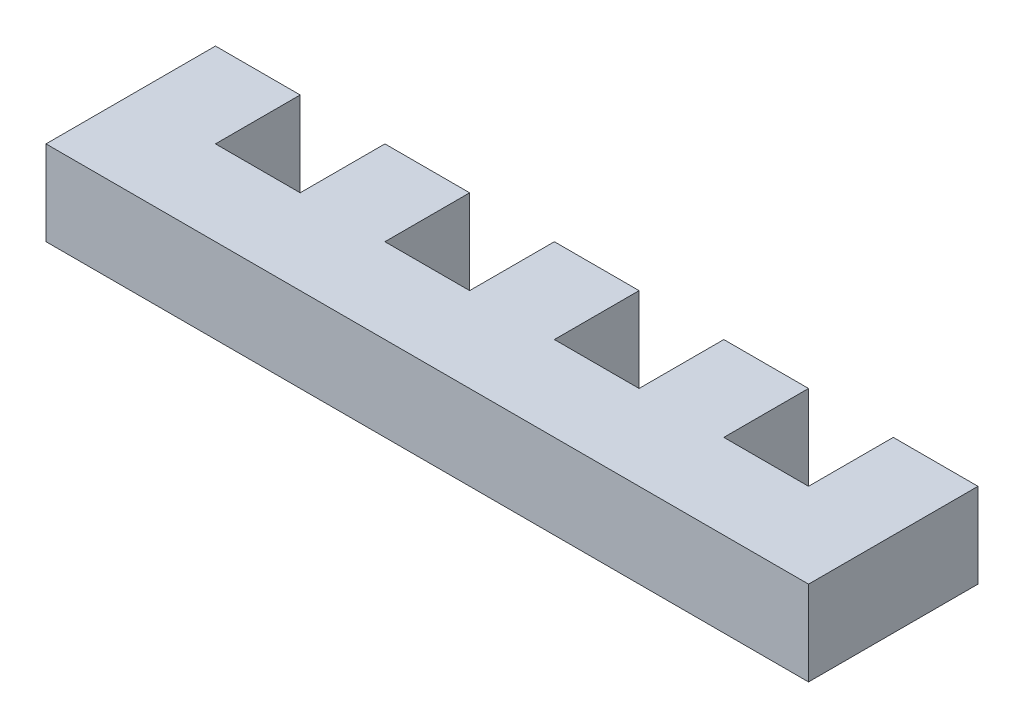
ISO-10303-21;
HEADER;
FILE_DESCRIPTION(('STEP AP214'),'2;1');
FILE_NAME('part.step','',(''),(''),'','','');
FILE_SCHEMA(('AUTOMOTIVE_DESIGN { 1 0 10303 214 1 1 1 1 }'));
ENDSEC;
DATA;
#1=APPLICATION_CONTEXT('core data for automotive mechanical design processes');
#2=APPLICATION_PROTOCOL_DEFINITION('international standard','automotive_design',2000,#1);
#3=PRODUCT_CONTEXT('',#1,'mechanical');
#4=PRODUCT('Part','Part','',(#3));
#5=PRODUCT_RELATED_PRODUCT_CATEGORY('part','',(#4));
#6=PRODUCT_DEFINITION_FORMATION('','',#4);
#7=PRODUCT_DEFINITION_CONTEXT('part definition',#1,'design');
#8=PRODUCT_DEFINITION('design','',#6,#7);
#9=PRODUCT_DEFINITION_SHAPE('','',#8);
#10=(LENGTH_UNIT() NAMED_UNIT(*) SI_UNIT(.MILLI.,.METRE.));
#11=(NAMED_UNIT(*) PLANE_ANGLE_UNIT() SI_UNIT($,.RADIAN.));
#12=(NAMED_UNIT(*) SI_UNIT($,.STERADIAN.) SOLID_ANGLE_UNIT());
#13=UNCERTAINTY_MEASURE_WITH_UNIT(LENGTH_MEASURE(1.E-05),#10,'distance_accuracy_value','');
#14=(GEOMETRIC_REPRESENTATION_CONTEXT(3) GLOBAL_UNCERTAINTY_ASSIGNED_CONTEXT((#13)) GLOBAL_UNIT_ASSIGNED_CONTEXT((#10,
#11,#12)) REPRESENTATION_CONTEXT('',''));
#15=CARTESIAN_POINT('',(0.,0.,0.));
#16=DIRECTION('',(0.,0.,1.));
#17=DIRECTION('',(1.,0.,0.));
#18=AXIS2_PLACEMENT_3D('',#15,#16,#17);
#19=CARTESIAN_POINT('',(0.,6.35,-12.7));
#20=DIRECTION('',(0.,0.,-1.));
#21=DIRECTION('',(-1.,0.,0.));
#22=AXIS2_PLACEMENT_3D('',#19,#20,#21);
#23=PLANE('',#22);
#24=DIRECTION('',(1.,0.,0.));
#25=VECTOR('',#24,1.);
#26=CARTESIAN_POINT('',(0.,0.,-12.7));
#27=LINE('',#26,#25);
#28=CARTESIAN_POINT('',(50.8,0.,-12.7));
#29=VERTEX_POINT('',#28);
#30=CARTESIAN_POINT('',(57.15,0.,-12.7));
#31=VERTEX_POINT('',#30);
#32=EDGE_CURVE('E204',#29,#31,#27,.T.);
#33=ORIENTED_EDGE('',*,*,#32,.F.);
#34=DIRECTION('',(0.,-1.,0.));
#35=VECTOR('',#34,1.);
#36=CARTESIAN_POINT('',(50.8,6.35,-12.7));
#37=LINE('',#36,#35);
#38=CARTESIAN_POINT('',(50.8,6.35,-12.7));
#39=VERTEX_POINT('',#38);
#40=EDGE_CURVE('E11',#39,#29,#37,.T.);
#41=ORIENTED_EDGE('',*,*,#40,.F.);
#42=DIRECTION('',(1.,0.,0.));
#43=VECTOR('',#42,1.);
#44=CARTESIAN_POINT('',(0.,6.35,-12.7));
#45=LINE('',#44,#43);
#46=CARTESIAN_POINT('',(57.15,6.35,-12.7));
#47=VERTEX_POINT('',#46);
#48=EDGE_CURVE('E199',#39,#47,#45,.T.);
#49=ORIENTED_EDGE('',*,*,#48,.T.);
#50=DIRECTION('',(0.,-1.,0.));
#51=VECTOR('',#50,1.);
#52=CARTESIAN_POINT('',(57.15,6.35,-12.7));
#53=LINE('',#52,#51);
#54=EDGE_CURVE('E120',#47,#31,#53,.T.);
#55=ORIENTED_EDGE('',*,*,#54,.T.);
#56=EDGE_LOOP('',(#33,#41,#49,#55));
#57=FACE_BOUND('',#56,.T.);
#58=ADVANCED_FACE('F33',(#57),#23,.T.);
#59=CARTESIAN_POINT('',(50.8,6.35,0.));
#60=DIRECTION('',(1.,0.,0.));
#61=DIRECTION('',(0.,0.,-1.));
#62=AXIS2_PLACEMENT_3D('',#59,#60,#61);
#63=PLANE('',#62);
#64=DIRECTION('',(0.,0.,1.));
#65=VECTOR('',#64,1.);
#66=CARTESIAN_POINT('',(50.8,0.,0.));
#67=LINE('',#66,#65);
#68=CARTESIAN_POINT('',(50.8,0.,-6.35));
#69=VERTEX_POINT('',#68);
#70=EDGE_CURVE('E207',#29,#69,#67,.T.);
#71=ORIENTED_EDGE('',*,*,#70,.T.);
#72=DIRECTION('',(0.,-1.,0.));
#73=VECTOR('',#72,1.);
#74=CARTESIAN_POINT('',(50.8,6.35,-6.35));
#75=LINE('',#74,#73);
#76=CARTESIAN_POINT('',(50.8,6.35,-6.35));
#77=VERTEX_POINT('',#76);
#78=EDGE_CURVE('E42',#77,#69,#75,.T.);
#79=ORIENTED_EDGE('',*,*,#78,.F.);
#80=DIRECTION('',(0.,0.,1.));
#81=VECTOR('',#80,1.);
#82=CARTESIAN_POINT('',(50.8,6.35,0.));
#83=LINE('',#82,#81);
#84=EDGE_CURVE('E303',#39,#77,#83,.T.);
#85=ORIENTED_EDGE('',*,*,#84,.F.);
#86=ORIENTED_EDGE('',*,*,#40,.T.);
#87=EDGE_LOOP('',(#71,#79,#85,#86));
#88=FACE_BOUND('',#87,.T.);
#89=ADVANCED_FACE('F35',(#88),#63,.F.);
#90=CARTESIAN_POINT('',(0.,6.35,-6.35000000000001));
#91=DIRECTION('',(0.,0.,-1.));
#92=DIRECTION('',(-1.,0.,0.));
#93=AXIS2_PLACEMENT_3D('',#90,#91,#92);
#94=PLANE('',#93);
#95=DIRECTION('',(1.,0.,0.));
#96=VECTOR('',#95,1.);
#97=CARTESIAN_POINT('',(0.,0.,-6.35000000000001));
#98=LINE('',#97,#96);
#99=CARTESIAN_POINT('',(44.45,0.,-6.35));
#100=VERTEX_POINT('',#99);
#101=EDGE_CURVE('E212',#100,#69,#98,.T.);
#102=ORIENTED_EDGE('',*,*,#101,.F.);
#103=DIRECTION('',(0.,-1.,0.));
#104=VECTOR('',#103,1.);
#105=CARTESIAN_POINT('',(44.45,6.35,-6.35));
#106=LINE('',#105,#104);
#107=CARTESIAN_POINT('',(44.45,6.35,-6.35));
#108=VERTEX_POINT('',#107);
#109=EDGE_CURVE('E280',#108,#100,#106,.T.);
#110=ORIENTED_EDGE('',*,*,#109,.F.);
#111=DIRECTION('',(1.,0.,0.));
#112=VECTOR('',#111,1.);
#113=CARTESIAN_POINT('',(0.,6.35,-6.35000000000001));
#114=LINE('',#113,#112);
#115=EDGE_CURVE('E287',#108,#77,#114,.T.);
#116=ORIENTED_EDGE('',*,*,#115,.T.);
#117=ORIENTED_EDGE('',*,*,#78,.T.);
#118=EDGE_LOOP('',(#102,#110,#116,#117));
#119=FACE_BOUND('',#118,.T.);
#120=ADVANCED_FACE('F285',(#119),#94,.T.);
#121=CARTESIAN_POINT('',(44.45,6.35,0.));
#122=DIRECTION('',(1.,0.,0.));
#123=DIRECTION('',(0.,0.,-1.));
#124=AXIS2_PLACEMENT_3D('',#121,#122,#123);
#125=PLANE('',#124);
#126=DIRECTION('',(0.,0.,1.));
#127=VECTOR('',#126,1.);
#128=CARTESIAN_POINT('',(44.45,0.,0.));
#129=LINE('',#128,#127);
#130=CARTESIAN_POINT('',(44.45,0.,-12.7));
#131=VERTEX_POINT('',#130);
#132=EDGE_CURVE('E215',#131,#100,#129,.T.);
#133=ORIENTED_EDGE('',*,*,#132,.F.);
#134=DIRECTION('',(0.,-1.,0.));
#135=VECTOR('',#134,1.);
#136=CARTESIAN_POINT('',(44.45,6.35,-12.7));
#137=LINE('',#136,#135);
#138=CARTESIAN_POINT('',(44.45,6.35,-12.7));
#139=VERTEX_POINT('',#138);
#140=EDGE_CURVE('E278',#139,#131,#137,.T.);
#141=ORIENTED_EDGE('',*,*,#140,.F.);
#142=DIRECTION('',(0.,0.,1.));
#143=VECTOR('',#142,1.);
#144=CARTESIAN_POINT('',(44.45,6.35,0.));
#145=LINE('',#144,#143);
#146=EDGE_CURVE('E300',#139,#108,#145,.T.);
#147=ORIENTED_EDGE('',*,*,#146,.T.);
#148=ORIENTED_EDGE('',*,*,#109,.T.);
#149=EDGE_LOOP('',(#133,#141,#147,#148));
#150=FACE_BOUND('',#149,.T.);
#151=ADVANCED_FACE('F297',(#150),#125,.T.);
#152=CARTESIAN_POINT('',(38.1,0.,-12.7));
#153=VERTEX_POINT('',#152);
#154=EDGE_CURVE('E209',#153,#131,#27,.T.);
#155=ORIENTED_EDGE('',*,*,#154,.F.);
#156=DIRECTION('',(0.,-1.,0.));
#157=VECTOR('',#156,1.);
#158=CARTESIAN_POINT('',(38.1,6.35,-12.7));
#159=LINE('',#158,#157);
#160=CARTESIAN_POINT('',(38.1,6.35,-12.7));
#161=VERTEX_POINT('',#160);
#162=EDGE_CURVE('E276',#161,#153,#159,.T.);
#163=ORIENTED_EDGE('',*,*,#162,.F.);
#164=EDGE_CURVE('E305',#161,#139,#45,.T.);
#165=ORIENTED_EDGE('',*,*,#164,.T.);
#166=ORIENTED_EDGE('',*,*,#140,.T.);
#167=EDGE_LOOP('',(#155,#163,#165,#166));
#168=FACE_BOUND('',#167,.T.);
#169=ADVANCED_FACE('F377',(#168),#23,.T.);
#170=CARTESIAN_POINT('',(38.1,6.35,0.));
#171=DIRECTION('',(1.,0.,0.));
#172=DIRECTION('',(0.,0.,-1.));
#173=AXIS2_PLACEMENT_3D('',#170,#171,#172);
#174=PLANE('',#173);
#175=DIRECTION('',(0.,0.,1.));
#176=VECTOR('',#175,1.);
#177=CARTESIAN_POINT('',(38.1,0.,0.));
#178=LINE('',#177,#176);
#179=CARTESIAN_POINT('',(38.1,0.,-6.35));
#180=VERTEX_POINT('',#179);
#181=EDGE_CURVE('E218',#153,#180,#178,.T.);
#182=ORIENTED_EDGE('',*,*,#181,.T.);
#183=DIRECTION('',(0.,-1.,0.));
#184=VECTOR('',#183,1.);
#185=CARTESIAN_POINT('',(38.1,6.35,-6.35));
#186=LINE('',#185,#184);
#187=CARTESIAN_POINT('',(38.1,6.35,-6.35));
#188=VERTEX_POINT('',#187);
#189=EDGE_CURVE('E274',#188,#180,#186,.T.);
#190=ORIENTED_EDGE('',*,*,#189,.F.);
#191=DIRECTION('',(0.,0.,1.));
#192=VECTOR('',#191,1.);
#193=CARTESIAN_POINT('',(38.1,6.35,0.));
#194=LINE('',#193,#192);
#195=EDGE_CURVE('E309',#161,#188,#194,.T.);
#196=ORIENTED_EDGE('',*,*,#195,.F.);
#197=ORIENTED_EDGE('',*,*,#162,.T.);
#198=EDGE_LOOP('',(#182,#190,#196,#197));
#199=FACE_BOUND('',#198,.T.);
#200=ADVANCED_FACE('F379',(#199),#174,.F.);
#201=CARTESIAN_POINT('',(0.,6.35,-6.35));
#202=DIRECTION('',(0.,0.,-1.));
#203=DIRECTION('',(-1.,0.,0.));
#204=AXIS2_PLACEMENT_3D('',#201,#202,#203);
#205=PLANE('',#204);
#206=DIRECTION('',(1.,0.,0.));
#207=VECTOR('',#206,1.);
#208=CARTESIAN_POINT('',(0.,0.,-6.35));
#209=LINE('',#208,#207);
#210=CARTESIAN_POINT('',(31.75,0.,-6.35));
#211=VERTEX_POINT('',#210);
#212=EDGE_CURVE('E221',#211,#180,#209,.T.);
#213=ORIENTED_EDGE('',*,*,#212,.F.);
#214=DIRECTION('',(0.,-1.,0.));
#215=VECTOR('',#214,1.);
#216=CARTESIAN_POINT('',(31.75,6.35,-6.35));
#217=LINE('',#216,#215);
#218=CARTESIAN_POINT('',(31.75,6.35,-6.35));
#219=VERTEX_POINT('',#218);
#220=EDGE_CURVE('E272',#219,#211,#217,.T.);
#221=ORIENTED_EDGE('',*,*,#220,.F.);
#222=DIRECTION('',(1.,0.,0.));
#223=VECTOR('',#222,1.);
#224=CARTESIAN_POINT('',(0.,6.35,-6.35));
#225=LINE('',#224,#223);
#226=EDGE_CURVE('E311',#219,#188,#225,.T.);
#227=ORIENTED_EDGE('',*,*,#226,.T.);
#228=ORIENTED_EDGE('',*,*,#189,.T.);
#229=EDGE_LOOP('',(#213,#221,#227,#228));
#230=FACE_BOUND('',#229,.T.);
#231=ADVANCED_FACE('F374',(#230),#205,.T.);
#232=CARTESIAN_POINT('',(31.75,6.35,0.));
#233=DIRECTION('',(1.,0.,0.));
#234=DIRECTION('',(0.,0.,-1.));
#235=AXIS2_PLACEMENT_3D('',#232,#233,#234);
#236=PLANE('',#235);
#237=DIRECTION('',(0.,0.,1.));
#238=VECTOR('',#237,1.);
#239=CARTESIAN_POINT('',(31.75,0.,0.));
#240=LINE('',#239,#238);
#241=CARTESIAN_POINT('',(31.75,0.,-12.7));
#242=VERTEX_POINT('',#241);
#243=EDGE_CURVE('E224',#242,#211,#240,.T.);
#244=ORIENTED_EDGE('',*,*,#243,.F.);
#245=DIRECTION('',(0.,-1.,0.));
#246=VECTOR('',#245,1.);
#247=CARTESIAN_POINT('',(31.75,6.35,-12.7));
#248=LINE('',#247,#246);
#249=CARTESIAN_POINT('',(31.75,6.35,-12.7));
#250=VERTEX_POINT('',#249);
#251=EDGE_CURVE('E270',#250,#242,#248,.T.);
#252=ORIENTED_EDGE('',*,*,#251,.F.);
#253=DIRECTION('',(0.,0.,1.));
#254=VECTOR('',#253,1.);
#255=CARTESIAN_POINT('',(31.75,6.35,0.));
#256=LINE('',#255,#254);
#257=EDGE_CURVE('E314',#250,#219,#256,.T.);
#258=ORIENTED_EDGE('',*,*,#257,.T.);
#259=ORIENTED_EDGE('',*,*,#220,.T.);
#260=EDGE_LOOP('',(#244,#252,#258,#259));
#261=FACE_BOUND('',#260,.T.);
#262=ADVANCED_FACE('F370',(#261),#236,.T.);
#263=CARTESIAN_POINT('',(25.4,0.,-12.7));
#264=VERTEX_POINT('',#263);
#265=EDGE_CURVE('E227',#264,#242,#27,.T.);
#266=ORIENTED_EDGE('',*,*,#265,.F.);
#267=DIRECTION('',(0.,-1.,0.));
#268=VECTOR('',#267,1.);
#269=CARTESIAN_POINT('',(25.4,6.35,-12.7));
#270=LINE('',#269,#268);
#271=CARTESIAN_POINT('',(25.4,6.35,-12.7));
#272=VERTEX_POINT('',#271);
#273=EDGE_CURVE('E268',#272,#264,#270,.T.);
#274=ORIENTED_EDGE('',*,*,#273,.F.);
#275=EDGE_CURVE('E317',#272,#250,#45,.T.);
#276=ORIENTED_EDGE('',*,*,#275,.T.);
#277=ORIENTED_EDGE('',*,*,#251,.T.);
#278=EDGE_LOOP('',(#266,#274,#276,#277));
#279=FACE_BOUND('',#278,.T.);
#280=ADVANCED_FACE('F366',(#279),#23,.T.);
#281=CARTESIAN_POINT('',(25.4,6.35,0.));
#282=DIRECTION('',(1.,0.,0.));
#283=DIRECTION('',(0.,0.,-1.));
#284=AXIS2_PLACEMENT_3D('',#281,#282,#283);
#285=PLANE('',#284);
#286=DIRECTION('',(0.,0.,1.));
#287=VECTOR('',#286,1.);
#288=CARTESIAN_POINT('',(25.4,0.,0.));
#289=LINE('',#288,#287);
#290=CARTESIAN_POINT('',(25.4,0.,-6.35));
#291=VERTEX_POINT('',#290);
#292=EDGE_CURVE('E228',#264,#291,#289,.T.);
#293=ORIENTED_EDGE('',*,*,#292,.T.);
#294=DIRECTION('',(0.,-1.,0.));
#295=VECTOR('',#294,1.);
#296=CARTESIAN_POINT('',(25.4,6.35,-6.35));
#297=LINE('',#296,#295);
#298=CARTESIAN_POINT('',(25.4,6.35,-6.35));
#299=VERTEX_POINT('',#298);
#300=EDGE_CURVE('E266',#299,#291,#297,.T.);
#301=ORIENTED_EDGE('',*,*,#300,.F.);
#302=DIRECTION('',(0.,0.,1.));
#303=VECTOR('',#302,1.);
#304=CARTESIAN_POINT('',(25.4,6.35,0.));
#305=LINE('',#304,#303);
#306=EDGE_CURVE('E318',#272,#299,#305,.T.);
#307=ORIENTED_EDGE('',*,*,#306,.F.);
#308=ORIENTED_EDGE('',*,*,#273,.T.);
#309=EDGE_LOOP('',(#293,#301,#307,#308));
#310=FACE_BOUND('',#309,.T.);
#311=ADVANCED_FACE('F382',(#310),#285,.F.);
#312=CARTESIAN_POINT('',(0.,6.35,-6.35));
#313=DIRECTION('',(0.,0.,-1.));
#314=DIRECTION('',(-1.,0.,0.));
#315=AXIS2_PLACEMENT_3D('',#312,#313,#314);
#316=PLANE('',#315);
#317=DIRECTION('',(1.,0.,0.));
#318=VECTOR('',#317,1.);
#319=CARTESIAN_POINT('',(0.,0.,-6.35));
#320=LINE('',#319,#318);
#321=CARTESIAN_POINT('',(19.05,0.,-6.35));
#322=VERTEX_POINT('',#321);
#323=EDGE_CURVE('E231',#322,#291,#320,.T.);
#324=ORIENTED_EDGE('',*,*,#323,.F.);
#325=DIRECTION('',(0.,-1.,0.));
#326=VECTOR('',#325,1.);
#327=CARTESIAN_POINT('',(19.05,6.35,-6.35));
#328=LINE('',#327,#326);
#329=CARTESIAN_POINT('',(19.05,6.35,-6.35));
#330=VERTEX_POINT('',#329);
#331=EDGE_CURVE('E264',#330,#322,#328,.T.);
#332=ORIENTED_EDGE('',*,*,#331,.F.);
#333=DIRECTION('',(1.,0.,0.));
#334=VECTOR('',#333,1.);
#335=CARTESIAN_POINT('',(0.,6.35,-6.35));
#336=LINE('',#335,#334);
#337=EDGE_CURVE('E320',#330,#299,#336,.T.);
#338=ORIENTED_EDGE('',*,*,#337,.T.);
#339=ORIENTED_EDGE('',*,*,#300,.T.);
#340=EDGE_LOOP('',(#324,#332,#338,#339));
#341=FACE_BOUND('',#340,.T.);
#342=ADVANCED_FACE('F384',(#341),#316,.T.);
#343=CARTESIAN_POINT('',(19.05,6.35,0.));
#344=DIRECTION('',(1.,0.,0.));
#345=DIRECTION('',(0.,0.,-1.));
#346=AXIS2_PLACEMENT_3D('',#343,#344,#345);
#347=PLANE('',#346);
#348=DIRECTION('',(0.,0.,1.));
#349=VECTOR('',#348,1.);
#350=CARTESIAN_POINT('',(19.05,0.,0.));
#351=LINE('',#350,#349);
#352=CARTESIAN_POINT('',(19.05,0.,-12.7));
#353=VERTEX_POINT('',#352);
#354=EDGE_CURVE('E234',#353,#322,#351,.T.);
#355=ORIENTED_EDGE('',*,*,#354,.F.);
#356=DIRECTION('',(0.,-1.,0.));
#357=VECTOR('',#356,1.);
#358=CARTESIAN_POINT('',(19.05,6.35,-12.7));
#359=LINE('',#358,#357);
#360=CARTESIAN_POINT('',(19.05,6.35,-12.7));
#361=VERTEX_POINT('',#360);
#362=EDGE_CURVE('E262',#361,#353,#359,.T.);
#363=ORIENTED_EDGE('',*,*,#362,.F.);
#364=DIRECTION('',(0.,0.,1.));
#365=VECTOR('',#364,1.);
#366=CARTESIAN_POINT('',(19.05,6.35,0.));
#367=LINE('',#366,#365);
#368=EDGE_CURVE('E323',#361,#330,#367,.T.);
#369=ORIENTED_EDGE('',*,*,#368,.T.);
#370=ORIENTED_EDGE('',*,*,#331,.T.);
#371=EDGE_LOOP('',(#355,#363,#369,#370));
#372=FACE_BOUND('',#371,.T.);
#373=ADVANCED_FACE('F358',(#372),#347,.T.);
#374=CARTESIAN_POINT('',(12.7,0.,-12.7));
#375=VERTEX_POINT('',#374);
#376=EDGE_CURVE('E237',#375,#353,#27,.T.);
#377=ORIENTED_EDGE('',*,*,#376,.F.);
#378=DIRECTION('',(0.,-1.,0.));
#379=VECTOR('',#378,1.);
#380=CARTESIAN_POINT('',(12.7,6.35,-12.7));
#381=LINE('',#380,#379);
#382=CARTESIAN_POINT('',(12.7,6.35,-12.7));
#383=VERTEX_POINT('',#382);
#384=EDGE_CURVE('E260',#383,#375,#381,.T.);
#385=ORIENTED_EDGE('',*,*,#384,.F.);
#386=EDGE_CURVE('E198',#383,#361,#45,.T.);
#387=ORIENTED_EDGE('',*,*,#386,.T.);
#388=ORIENTED_EDGE('',*,*,#362,.T.);
#389=EDGE_LOOP('',(#377,#385,#387,#388));
#390=FACE_BOUND('',#389,.T.);
#391=ADVANCED_FACE('F351',(#390),#23,.T.);
#392=CARTESIAN_POINT('',(12.7,6.35,0.));
#393=DIRECTION('',(1.,0.,0.));
#394=DIRECTION('',(0.,0.,-1.));
#395=AXIS2_PLACEMENT_3D('',#392,#393,#394);
#396=PLANE('',#395);
#397=DIRECTION('',(0.,0.,1.));
#398=VECTOR('',#397,1.);
#399=CARTESIAN_POINT('',(12.7,0.,0.));
#400=LINE('',#399,#398);
#401=CARTESIAN_POINT('',(12.7,0.,-6.35));
#402=VERTEX_POINT('',#401);
#403=EDGE_CURVE('E238',#375,#402,#400,.T.);
#404=ORIENTED_EDGE('',*,*,#403,.T.);
#405=DIRECTION('',(0.,-1.,0.));
#406=VECTOR('',#405,1.);
#407=CARTESIAN_POINT('',(12.7,6.35,-6.35));
#408=LINE('',#407,#406);
#409=CARTESIAN_POINT('',(12.7,6.35,-6.35));
#410=VERTEX_POINT('',#409);
#411=EDGE_CURVE('E258',#410,#402,#408,.T.);
#412=ORIENTED_EDGE('',*,*,#411,.F.);
#413=DIRECTION('',(0.,0.,1.));
#414=VECTOR('',#413,1.);
#415=CARTESIAN_POINT('',(12.7,6.35,0.));
#416=LINE('',#415,#414);
#417=EDGE_CURVE('E326',#383,#410,#416,.T.);
#418=ORIENTED_EDGE('',*,*,#417,.F.);
#419=ORIENTED_EDGE('',*,*,#384,.T.);
#420=EDGE_LOOP('',(#404,#412,#418,#419));
#421=FACE_BOUND('',#420,.T.);
#422=ADVANCED_FACE('F408',(#421),#396,.F.);
#423=CARTESIAN_POINT('',(0.,6.35,-6.35));
#424=DIRECTION('',(0.,0.,-1.));
#425=DIRECTION('',(-1.,0.,0.));
#426=AXIS2_PLACEMENT_3D('',#423,#424,#425);
#427=PLANE('',#426);
#428=DIRECTION('',(1.,0.,0.));
#429=VECTOR('',#428,1.);
#430=CARTESIAN_POINT('',(0.,0.,-6.35));
#431=LINE('',#430,#429);
#432=CARTESIAN_POINT('',(6.35,0.,-6.35));
#433=VERTEX_POINT('',#432);
#434=EDGE_CURVE('E241',#433,#402,#431,.T.);
#435=ORIENTED_EDGE('',*,*,#434,.F.);
#436=DIRECTION('',(0.,-1.,0.));
#437=VECTOR('',#436,1.);
#438=CARTESIAN_POINT('',(6.35,6.35,-6.35));
#439=LINE('',#438,#437);
#440=CARTESIAN_POINT('',(6.35,6.35,-6.35));
#441=VERTEX_POINT('',#440);
#442=EDGE_CURVE('E256',#441,#433,#439,.T.);
#443=ORIENTED_EDGE('',*,*,#442,.F.);
#444=DIRECTION('',(1.,0.,0.));
#445=VECTOR('',#444,1.);
#446=CARTESIAN_POINT('',(0.,6.35,-6.35));
#447=LINE('',#446,#445);
#448=EDGE_CURVE('E327',#441,#410,#447,.T.);
#449=ORIENTED_EDGE('',*,*,#448,.T.);
#450=ORIENTED_EDGE('',*,*,#411,.T.);
#451=EDGE_LOOP('',(#435,#443,#449,#450));
#452=FACE_BOUND('',#451,.T.);
#453=ADVANCED_FACE('F406',(#452),#427,.T.);
#454=CARTESIAN_POINT('',(6.35,6.35,0.));
#455=DIRECTION('',(1.,0.,0.));
#456=DIRECTION('',(0.,0.,-1.));
#457=AXIS2_PLACEMENT_3D('',#454,#455,#456);
#458=PLANE('',#457);
#459=DIRECTION('',(0.,0.,1.));
#460=VECTOR('',#459,1.);
#461=CARTESIAN_POINT('',(6.35,0.,0.));
#462=LINE('',#461,#460);
#463=CARTESIAN_POINT('',(6.35,0.,-12.7));
#464=VERTEX_POINT('',#463);
#465=EDGE_CURVE('E244',#464,#433,#462,.T.);
#466=ORIENTED_EDGE('',*,*,#465,.F.);
#467=DIRECTION('',(0.,-1.,0.));
#468=VECTOR('',#467,1.);
#469=CARTESIAN_POINT('',(6.35,6.35,-12.7));
#470=LINE('',#469,#468);
#471=CARTESIAN_POINT('',(6.35,6.35,-12.7));
#472=VERTEX_POINT('',#471);
#473=EDGE_CURVE('E254',#472,#464,#470,.T.);
#474=ORIENTED_EDGE('',*,*,#473,.F.);
#475=DIRECTION('',(0.,0.,1.));
#476=VECTOR('',#475,1.);
#477=CARTESIAN_POINT('',(6.35,6.35,0.));
#478=LINE('',#477,#476);
#479=EDGE_CURVE('E196',#472,#441,#478,.T.);
#480=ORIENTED_EDGE('',*,*,#479,.T.);
#481=ORIENTED_EDGE('',*,*,#442,.T.);
#482=EDGE_LOOP('',(#466,#474,#480,#481));
#483=FACE_BOUND('',#482,.T.);
#484=ADVANCED_FACE('F334',(#483),#458,.T.);
#485=CARTESIAN_POINT('',(0.,0.,-12.7));
#486=VERTEX_POINT('',#485);
#487=EDGE_CURVE('E208',#486,#464,#27,.T.);
#488=ORIENTED_EDGE('',*,*,#487,.F.);
#489=DIRECTION('',(0.,-1.,0.));
#490=VECTOR('',#489,1.);
#491=CARTESIAN_POINT('',(0.,6.35,-12.7));
#492=LINE('',#491,#490);
#493=CARTESIAN_POINT('',(0.,6.35,-12.7));
#494=VERTEX_POINT('',#493);
#495=EDGE_CURVE('E184',#494,#486,#492,.T.);
#496=ORIENTED_EDGE('',*,*,#495,.F.);
#497=EDGE_CURVE('E194',#494,#472,#45,.T.);
#498=ORIENTED_EDGE('',*,*,#497,.T.);
#499=ORIENTED_EDGE('',*,*,#473,.T.);
#500=EDGE_LOOP('',(#488,#496,#498,#499));
#501=FACE_BOUND('',#500,.T.);
#502=ADVANCED_FACE('F338',(#501),#23,.T.);
#503=CARTESIAN_POINT('',(0.,6.35,0.));
#504=DIRECTION('',(-1.,0.,0.));
#505=DIRECTION('',(0.,0.,1.));
#506=AXIS2_PLACEMENT_3D('',#503,#504,#505);
#507=PLANE('',#506);
#508=DIRECTION('',(0.,0.,-1.));
#509=VECTOR('',#508,1.);
#510=CARTESIAN_POINT('',(0.,0.,0.));
#511=LINE('',#510,#509);
#512=CARTESIAN_POINT('',(0.,0.,0.));
#513=VERTEX_POINT('',#512);
#514=EDGE_CURVE('E183',#513,#486,#511,.T.);
#515=ORIENTED_EDGE('',*,*,#514,.F.);
#516=DIRECTION('',(0.,-1.,0.));
#517=VECTOR('',#516,1.);
#518=CARTESIAN_POINT('',(0.,6.35,0.));
#519=LINE('',#518,#517);
#520=CARTESIAN_POINT('',(0.,6.35,0.));
#521=VERTEX_POINT('',#520);
#522=EDGE_CURVE('E177',#521,#513,#519,.T.);
#523=ORIENTED_EDGE('',*,*,#522,.F.);
#524=DIRECTION('',(0.,0.,-1.));
#525=VECTOR('',#524,1.);
#526=CARTESIAN_POINT('',(0.,6.35,0.));
#527=LINE('',#526,#525);
#528=EDGE_CURVE('E181',#521,#494,#527,.T.);
#529=ORIENTED_EDGE('',*,*,#528,.T.);
#530=ORIENTED_EDGE('',*,*,#495,.T.);
#531=EDGE_LOOP('',(#515,#523,#529,#530));
#532=FACE_BOUND('',#531,.T.);
#533=ADVANCED_FACE('F179',(#532),#507,.T.);
#534=CARTESIAN_POINT('',(0.,6.35,0.));
#535=DIRECTION('',(0.,0.,-1.));
#536=DIRECTION('',(-1.,0.,0.));
#537=AXIS2_PLACEMENT_3D('',#534,#535,#536);
#538=PLANE('',#537);
#539=DIRECTION('',(1.,0.,0.));
#540=VECTOR('',#539,1.);
#541=CARTESIAN_POINT('',(0.,0.,0.));
#542=LINE('',#541,#540);
#543=CARTESIAN_POINT('',(57.15,0.,0.));
#544=VERTEX_POINT('',#543);
#545=EDGE_CURVE('E113',#513,#544,#542,.T.);
#546=ORIENTED_EDGE('',*,*,#545,.T.);
#547=DIRECTION('',(0.,-1.,0.));
#548=VECTOR('',#547,1.);
#549=CARTESIAN_POINT('',(57.15,6.35,0.));
#550=LINE('',#549,#548);
#551=CARTESIAN_POINT('',(57.15,6.35,0.));
#552=VERTEX_POINT('',#551);
#553=EDGE_CURVE('E185',#552,#544,#550,.T.);
#554=ORIENTED_EDGE('',*,*,#553,.F.);
#555=DIRECTION('',(1.,0.,0.));
#556=VECTOR('',#555,1.);
#557=CARTESIAN_POINT('',(0.,6.35,0.));
#558=LINE('',#557,#556);
#559=EDGE_CURVE('E187',#521,#552,#558,.T.);
#560=ORIENTED_EDGE('',*,*,#559,.F.);
#561=ORIENTED_EDGE('',*,*,#522,.T.);
#562=EDGE_LOOP('',(#546,#554,#560,#561));
#563=FACE_BOUND('',#562,.T.);
#564=ADVANCED_FACE('F188',(#563),#538,.F.);
#565=CARTESIAN_POINT('',(57.15,6.35,0.));
#566=DIRECTION('',(-1.,0.,0.));
#567=DIRECTION('',(0.,0.,1.));
#568=AXIS2_PLACEMENT_3D('',#565,#566,#567);
#569=PLANE('',#568);
#570=DIRECTION('',(0.,0.,-1.));
#571=VECTOR('',#570,1.);
#572=CARTESIAN_POINT('',(57.15,0.,0.));
#573=LINE('',#572,#571);
#574=EDGE_CURVE('E249',#544,#31,#573,.T.);
#575=ORIENTED_EDGE('',*,*,#574,.T.);
#576=ORIENTED_EDGE('',*,*,#54,.F.);
#577=DIRECTION('',(0.,0.,-1.));
#578=VECTOR('',#577,1.);
#579=CARTESIAN_POINT('',(57.15,6.35,0.));
#580=LINE('',#579,#578);
#581=EDGE_CURVE('E50',#552,#47,#580,.T.);
#582=ORIENTED_EDGE('',*,*,#581,.F.);
#583=ORIENTED_EDGE('',*,*,#553,.T.);
#584=EDGE_LOOP('',(#575,#576,#582,#583));
#585=FACE_BOUND('',#584,.T.);
#586=ADVANCED_FACE('F342',(#585),#569,.F.);
#587=CARTESIAN_POINT('',(0.,6.35,0.));
#588=DIRECTION('',(0.,1.,0.));
#589=DIRECTION('',(0.,0.,1.));
#590=AXIS2_PLACEMENT_3D('',#587,#588,#589);
#591=PLANE('',#590);
#592=ORIENTED_EDGE('',*,*,#48,.F.);
#593=ORIENTED_EDGE('',*,*,#84,.T.);
#594=ORIENTED_EDGE('',*,*,#115,.F.);
#595=ORIENTED_EDGE('',*,*,#146,.F.);
#596=ORIENTED_EDGE('',*,*,#164,.F.);
#597=ORIENTED_EDGE('',*,*,#195,.T.);
#598=ORIENTED_EDGE('',*,*,#226,.F.);
#599=ORIENTED_EDGE('',*,*,#257,.F.);
#600=ORIENTED_EDGE('',*,*,#275,.F.);
#601=ORIENTED_EDGE('',*,*,#306,.T.);
#602=ORIENTED_EDGE('',*,*,#337,.F.);
#603=ORIENTED_EDGE('',*,*,#368,.F.);
#604=ORIENTED_EDGE('',*,*,#386,.F.);
#605=ORIENTED_EDGE('',*,*,#417,.T.);
#606=ORIENTED_EDGE('',*,*,#448,.F.);
#607=ORIENTED_EDGE('',*,*,#479,.F.);
#608=ORIENTED_EDGE('',*,*,#497,.F.);
#609=ORIENTED_EDGE('',*,*,#528,.F.);
#610=ORIENTED_EDGE('',*,*,#559,.T.);
#611=ORIENTED_EDGE('',*,*,#581,.T.);
#612=EDGE_LOOP('',(#592,#593,#594,#595,#596,#597,#598,#599,#600,#601,#602,#603,#604,#605,#606,
#607,#608,#609,#610,#611));
#613=FACE_BOUND('',#612,.T.);
#614=ADVANCED_FACE('F191',(#613),#591,.T.);
#615=CARTESIAN_POINT('',(0.,0.,0.));
#616=DIRECTION('',(0.,1.,0.));
#617=DIRECTION('',(0.,0.,1.));
#618=AXIS2_PLACEMENT_3D('',#615,#616,#617);
#619=PLANE('',#618);
#620=ORIENTED_EDGE('',*,*,#32,.T.);
#621=ORIENTED_EDGE('',*,*,#574,.F.);
#622=ORIENTED_EDGE('',*,*,#545,.F.);
#623=ORIENTED_EDGE('',*,*,#514,.T.);
#624=ORIENTED_EDGE('',*,*,#487,.T.);
#625=ORIENTED_EDGE('',*,*,#465,.T.);
#626=ORIENTED_EDGE('',*,*,#434,.T.);
#627=ORIENTED_EDGE('',*,*,#403,.F.);
#628=ORIENTED_EDGE('',*,*,#376,.T.);
#629=ORIENTED_EDGE('',*,*,#354,.T.);
#630=ORIENTED_EDGE('',*,*,#323,.T.);
#631=ORIENTED_EDGE('',*,*,#292,.F.);
#632=ORIENTED_EDGE('',*,*,#265,.T.);
#633=ORIENTED_EDGE('',*,*,#243,.T.);
#634=ORIENTED_EDGE('',*,*,#212,.T.);
#635=ORIENTED_EDGE('',*,*,#181,.F.);
#636=ORIENTED_EDGE('',*,*,#154,.T.);
#637=ORIENTED_EDGE('',*,*,#132,.T.);
#638=ORIENTED_EDGE('',*,*,#101,.T.);
#639=ORIENTED_EDGE('',*,*,#70,.F.);
#640=EDGE_LOOP('',(#620,#621,#622,#623,#624,#625,#626,#627,#628,#629,#630,#631,#632,#633,#634,
#635,#636,#637,#638,#639));
#641=FACE_BOUND('',#640,.T.);
#642=ADVANCED_FACE('F291',(#641),#619,.F.);
#643=CLOSED_SHELL('',(#58,#89,#120,#151,#169,#200,#231,#262,#280,#311,#342,#373,#391,#422,#453,
#484,#502,#533,#564,#586,#614,#642));
#644=MANIFOLD_SOLID_BREP('B2',#643);
#645=ADVANCED_BREP_SHAPE_REPRESENTATION('',(#18,#644),#14);
#646=SHAPE_DEFINITION_REPRESENTATION(#9,#645);
ENDSEC;
END-ISO-10303-21;
